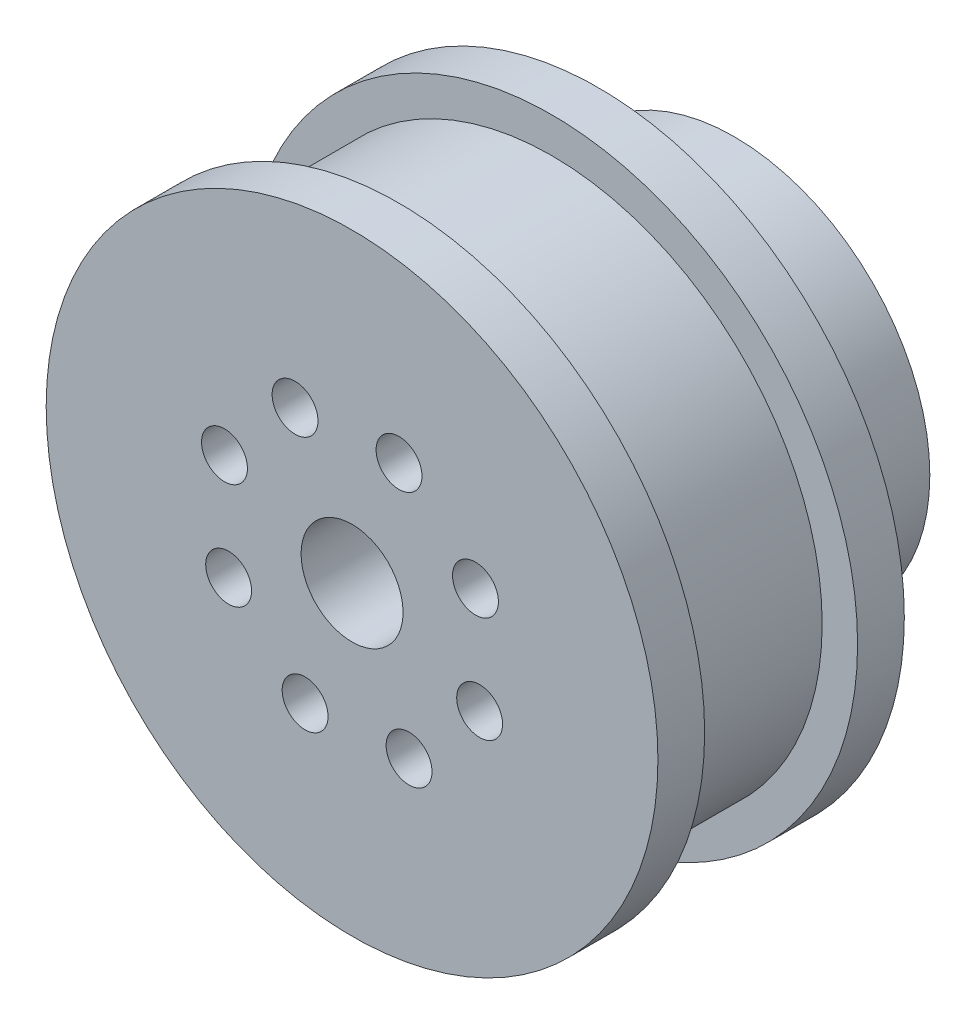
ISO-10303-21;
HEADER;
FILE_DESCRIPTION(('STEP AP214'),'2;1');
FILE_NAME('part.step','',(''),(''),'','','');
FILE_SCHEMA(('AUTOMOTIVE_DESIGN { 1 0 10303 214 1 1 1 1 }'));
ENDSEC;
DATA;
#1=APPLICATION_CONTEXT('core data for automotive mechanical design processes');
#2=APPLICATION_PROTOCOL_DEFINITION('international standard','automotive_design',2000,#1);
#3=PRODUCT_CONTEXT('',#1,'mechanical');
#4=PRODUCT('Part','Part','',(#3));
#5=PRODUCT_RELATED_PRODUCT_CATEGORY('part','',(#4));
#6=PRODUCT_DEFINITION_FORMATION('','',#4);
#7=PRODUCT_DEFINITION_CONTEXT('part definition',#1,'design');
#8=PRODUCT_DEFINITION('design','',#6,#7);
#9=PRODUCT_DEFINITION_SHAPE('','',#8);
#10=(LENGTH_UNIT() NAMED_UNIT(*) SI_UNIT(.MILLI.,.METRE.));
#11=(NAMED_UNIT(*) PLANE_ANGLE_UNIT() SI_UNIT($,.RADIAN.));
#12=(NAMED_UNIT(*) SI_UNIT($,.STERADIAN.) SOLID_ANGLE_UNIT());
#13=UNCERTAINTY_MEASURE_WITH_UNIT(LENGTH_MEASURE(1.E-05),#10,'distance_accuracy_value','');
#14=(GEOMETRIC_REPRESENTATION_CONTEXT(3) GLOBAL_UNCERTAINTY_ASSIGNED_CONTEXT((#13)) GLOBAL_UNIT_ASSIGNED_CONTEXT((#10,
#11,#12)) REPRESENTATION_CONTEXT('',''));
#15=CARTESIAN_POINT('',(0.,0.,0.));
#16=DIRECTION('',(0.,0.,1.));
#17=DIRECTION('',(1.,0.,0.));
#18=AXIS2_PLACEMENT_3D('',#15,#16,#17);
#19=CARTESIAN_POINT('',(0.,0.,14.5));
#20=DIRECTION('',(0.,0.,-1.));
#21=DIRECTION('',(-1.,0.,0.));
#22=AXIS2_PLACEMENT_3D('',#19,#20,#21);
#23=CYLINDRICAL_SURFACE('',#22,3.);
#24=CARTESIAN_POINT('',(0.,0.,14.5));
#25=DIRECTION('',(0.,0.,-1.));
#26=DIRECTION('',(-1.,0.,0.));
#27=AXIS2_PLACEMENT_3D('',#24,#25,#26);
#28=CIRCLE('',#27,3.);
#29=CARTESIAN_POINT('',(-3.,0.,14.5));
#30=VERTEX_POINT('',#29);
#31=EDGE_CURVE('E63',#30,#30,#28,.T.);
#32=ORIENTED_EDGE('',*,*,#31,.F.);
#33=EDGE_LOOP('',(#32));
#34=FACE_BOUND('',#33,.T.);
#35=CARTESIAN_POINT('',(0.,0.,2.));
#36=DIRECTION('',(0.,0.,-1.));
#37=DIRECTION('',(-1.,0.,0.));
#38=AXIS2_PLACEMENT_3D('',#35,#36,#37);
#39=CIRCLE('',#38,3.);
#40=CARTESIAN_POINT('',(-3.,0.,2.));
#41=VERTEX_POINT('',#40);
#42=EDGE_CURVE('E35',#41,#41,#39,.F.);
#43=ORIENTED_EDGE('',*,*,#42,.F.);
#44=EDGE_LOOP('',(#43));
#45=FACE_BOUND('',#44,.T.);
#46=ADVANCED_FACE('F31',(#34,#45),#23,.F.);
#47=CARTESIAN_POINT('',(0.,0.,0.));
#48=DIRECTION('',(0.,0.,1.));
#49=DIRECTION('',(1.,0.,0.));
#50=AXIS2_PLACEMENT_3D('',#47,#48,#49);
#51=PLANE('',#50);
#52=CARTESIAN_POINT('',(0.,0.,0.));
#53=DIRECTION('',(0.,0.,1.));
#54=DIRECTION('',(1.,0.,0.));
#55=AXIS2_PLACEMENT_3D('',#52,#53,#54);
#56=CIRCLE('',#55,18.);
#57=CARTESIAN_POINT('',(18.,0.,0.));
#58=VERTEX_POINT('',#57);
#59=EDGE_CURVE('E43',#58,#58,#56,.T.);
#60=ORIENTED_EDGE('',*,*,#59,.F.);
#61=EDGE_LOOP('',(#60));
#62=FACE_BOUND('',#61,.T.);
#63=CARTESIAN_POINT('',(0.,0.,0.));
#64=DIRECTION('',(0.,0.,1.));
#65=DIRECTION('',(1.,0.,0.));
#66=AXIS2_PLACEMENT_3D('',#63,#64,#65);
#67=CIRCLE('',#66,11.5);
#68=CARTESIAN_POINT('',(11.5,0.,0.));
#69=VERTEX_POINT('',#68);
#70=EDGE_CURVE('E10',#69,#69,#67,.F.);
#71=ORIENTED_EDGE('',*,*,#70,.F.);
#72=EDGE_LOOP('',(#71));
#73=FACE_BOUND('',#72,.T.);
#74=ADVANCED_FACE('F165',(#62,#73),#51,.F.);
#75=CARTESIAN_POINT('',(0.,0.,2.75));
#76=DIRECTION('',(0.,0.,1.));
#77=DIRECTION('',(1.,0.,0.));
#78=AXIS2_PLACEMENT_3D('',#75,#76,#77);
#79=PLANE('',#78);
#80=CARTESIAN_POINT('',(0.,0.,2.75));
#81=DIRECTION('',(0.,0.,1.));
#82=DIRECTION('',(1.,0.,0.));
#83=AXIS2_PLACEMENT_3D('',#80,#81,#82);
#84=CIRCLE('',#83,18.);
#85=CARTESIAN_POINT('',(18.,0.,2.75));
#86=VERTEX_POINT('',#85);
#87=EDGE_CURVE('E39',#86,#86,#84,.T.);
#88=ORIENTED_EDGE('',*,*,#87,.T.);
#89=EDGE_LOOP('',(#88));
#90=FACE_BOUND('',#89,.T.);
#91=CARTESIAN_POINT('',(0.,0.,2.75));
#92=DIRECTION('',(0.,0.,1.));
#93=DIRECTION('',(1.,0.,0.));
#94=AXIS2_PLACEMENT_3D('',#91,#92,#93);
#95=CIRCLE('',#94,15.915);
#96=CARTESIAN_POINT('',(15.915,0.,2.75));
#97=VERTEX_POINT('',#96);
#98=EDGE_CURVE('E49',#97,#97,#95,.T.);
#99=ORIENTED_EDGE('',*,*,#98,.F.);
#100=EDGE_LOOP('',(#99));
#101=FACE_BOUND('',#100,.T.);
#102=ADVANCED_FACE('F172',(#90,#101),#79,.T.);
#103=CARTESIAN_POINT('',(0.,0.,2.75));
#104=DIRECTION('',(0.,0.,-1.));
#105=DIRECTION('',(-1.,0.,0.));
#106=AXIS2_PLACEMENT_3D('',#103,#104,#105);
#107=CYLINDRICAL_SURFACE('',#106,18.);
#108=ORIENTED_EDGE('',*,*,#87,.F.);
#109=EDGE_LOOP('',(#108));
#110=FACE_BOUND('',#109,.T.);
#111=ORIENTED_EDGE('',*,*,#59,.T.);
#112=EDGE_LOOP('',(#111));
#113=FACE_BOUND('',#112,.T.);
#114=ADVANCED_FACE('F33',(#110,#113),#107,.T.);
#115=CARTESIAN_POINT('',(0.,0.,11.75));
#116=DIRECTION('',(0.,0.,-1.));
#117=DIRECTION('',(-1.,0.,0.));
#118=AXIS2_PLACEMENT_3D('',#115,#116,#117);
#119=CYLINDRICAL_SURFACE('',#118,15.915);
#120=CARTESIAN_POINT('',(0.,0.,11.75));
#121=DIRECTION('',(0.,0.,1.));
#122=DIRECTION('',(1.,0.,0.));
#123=AXIS2_PLACEMENT_3D('',#120,#121,#122);
#124=CIRCLE('',#123,15.915);
#125=CARTESIAN_POINT('',(15.915,0.,11.75));
#126=VERTEX_POINT('',#125);
#127=EDGE_CURVE('E47',#126,#126,#124,.T.);
#128=ORIENTED_EDGE('',*,*,#127,.F.);
#129=EDGE_LOOP('',(#128));
#130=FACE_BOUND('',#129,.T.);
#131=ORIENTED_EDGE('',*,*,#98,.T.);
#132=EDGE_LOOP('',(#131));
#133=FACE_BOUND('',#132,.T.);
#134=ADVANCED_FACE('F238',(#130,#133),#119,.T.);
#135=CARTESIAN_POINT('',(0.,0.,11.75));
#136=DIRECTION('',(0.,0.,1.));
#137=DIRECTION('',(1.,0.,0.));
#138=AXIS2_PLACEMENT_3D('',#135,#136,#137);
#139=PLANE('',#138);
#140=CARTESIAN_POINT('',(0.,0.,11.75));
#141=DIRECTION('',(0.,0.,1.));
#142=DIRECTION('',(1.,0.,0.));
#143=AXIS2_PLACEMENT_3D('',#140,#141,#142);
#144=CIRCLE('',#143,18.);
#145=CARTESIAN_POINT('',(18.,0.,11.75));
#146=VERTEX_POINT('',#145);
#147=EDGE_CURVE('E55',#146,#146,#144,.T.);
#148=ORIENTED_EDGE('',*,*,#147,.F.);
#149=EDGE_LOOP('',(#148));
#150=FACE_BOUND('',#149,.T.);
#151=ORIENTED_EDGE('',*,*,#127,.T.);
#152=EDGE_LOOP('',(#151));
#153=FACE_BOUND('',#152,.T.);
#154=ADVANCED_FACE('F232',(#150,#153),#139,.F.);
#155=CARTESIAN_POINT('',(0.,0.,14.5));
#156=DIRECTION('',(0.,0.,-1.));
#157=DIRECTION('',(-1.,0.,0.));
#158=AXIS2_PLACEMENT_3D('',#155,#156,#157);
#159=CYLINDRICAL_SURFACE('',#158,18.);
#160=CARTESIAN_POINT('',(0.,0.,14.5));
#161=DIRECTION('',(0.,0.,1.));
#162=DIRECTION('',(1.,0.,0.));
#163=AXIS2_PLACEMENT_3D('',#160,#161,#162);
#164=CIRCLE('',#163,18.);
#165=CARTESIAN_POINT('',(18.,0.,14.5));
#166=VERTEX_POINT('',#165);
#167=EDGE_CURVE('E52',#166,#166,#164,.T.);
#168=ORIENTED_EDGE('',*,*,#167,.F.);
#169=EDGE_LOOP('',(#168));
#170=FACE_BOUND('',#169,.T.);
#171=ORIENTED_EDGE('',*,*,#147,.T.);
#172=EDGE_LOOP('',(#171));
#173=FACE_BOUND('',#172,.T.);
#174=ADVANCED_FACE('F162',(#170,#173),#159,.T.);
#175=CARTESIAN_POINT('',(0.,0.,14.5));
#176=DIRECTION('',(0.,0.,1.));
#177=DIRECTION('',(1.,0.,0.));
#178=AXIS2_PLACEMENT_3D('',#175,#176,#177);
#179=PLANE('',#178);
#180=CARTESIAN_POINT('',(-7.50750981873218,2.76356587068952,14.5));
#181=DIRECTION('',(0.,0.,-1.));
#182=DIRECTION('',(-0.707106781186554,-0.707106781186541,0.));
#183=AXIS2_PLACEMENT_3D('',#180,#181,#182);
#184=CIRCLE('',#183,1.35);
#185=CARTESIAN_POINT('',(-8.46210397333403,1.80897171608769,14.5));
#186=VERTEX_POINT('',#185);
#187=EDGE_CURVE('E112',#186,#186,#184,.T.);
#188=ORIENTED_EDGE('',*,*,#187,.T.);
#189=EDGE_LOOP('',(#188));
#190=FACE_BOUND('',#189,.T.);
#191=CARTESIAN_POINT('',(-7.26274727007037,-3.35447493522986,14.5));
#192=DIRECTION('',(0.,0.,-1.));
#193=DIRECTION('',(0.,-1.,0.));
#194=AXIS2_PLACEMENT_3D('',#191,#192,#193);
#195=CIRCLE('',#194,1.35);
#196=CARTESIAN_POINT('',(-7.26274727007038,-4.70447493522986,14.5));
#197=VERTEX_POINT('',#196);
#198=EDGE_CURVE('E106',#197,#197,#195,.T.);
#199=ORIENTED_EDGE('',*,*,#198,.T.);
#200=EDGE_LOOP('',(#199));
#201=FACE_BOUND('',#200,.T.);
#202=CARTESIAN_POINT('',(-2.76356587068949,-7.50750981873219,14.5));
#203=DIRECTION('',(0.,0.,-1.));
#204=DIRECTION('',(0.707106781186543,-0.707106781186552,0.));
#205=AXIS2_PLACEMENT_3D('',#202,#203,#204);
#206=CIRCLE('',#205,1.35);
#207=CARTESIAN_POINT('',(-1.80897171608766,-8.46210397333403,14.5));
#208=VERTEX_POINT('',#207);
#209=EDGE_CURVE('E100',#208,#208,#206,.T.);
#210=ORIENTED_EDGE('',*,*,#209,.T.);
#211=EDGE_LOOP('',(#210));
#212=FACE_BOUND('',#211,.T.);
#213=CARTESIAN_POINT('',(3.35447493522988,-7.26274727007036,14.5));
#214=DIRECTION('',(0.,0.,-1.));
#215=DIRECTION('',(1.,0.,0.));
#216=AXIS2_PLACEMENT_3D('',#213,#214,#215);
#217=CIRCLE('',#216,1.35);
#218=CARTESIAN_POINT('',(4.70447493522988,-7.26274727007037,14.5));
#219=VERTEX_POINT('',#218);
#220=EDGE_CURVE('E94',#219,#219,#217,.T.);
#221=ORIENTED_EDGE('',*,*,#220,.T.);
#222=EDGE_LOOP('',(#221));
#223=FACE_BOUND('',#222,.T.);
#224=CARTESIAN_POINT('',(7.5075098187322,-2.76356587068948,14.5));
#225=DIRECTION('',(0.,0.,-1.));
#226=DIRECTION('',(0.70710678118655,0.707106781186545,0.));
#227=AXIS2_PLACEMENT_3D('',#224,#225,#226);
#228=CIRCLE('',#227,1.35);
#229=CARTESIAN_POINT('',(8.46210397333404,-1.80897171608764,14.5));
#230=VERTEX_POINT('',#229);
#231=EDGE_CURVE('E88',#230,#230,#228,.T.);
#232=ORIENTED_EDGE('',*,*,#231,.T.);
#233=EDGE_LOOP('',(#232));
#234=FACE_BOUND('',#233,.T.);
#235=CARTESIAN_POINT('',(7.26274727007035,3.3544749352299,14.5));
#236=DIRECTION('',(0.,0.,-1.));
#237=DIRECTION('',(0.,1.,0.));
#238=AXIS2_PLACEMENT_3D('',#235,#236,#237);
#239=CIRCLE('',#238,1.35);
#240=CARTESIAN_POINT('',(7.26274727007036,4.7044749352299,14.5));
#241=VERTEX_POINT('',#240);
#242=EDGE_CURVE('E82',#241,#241,#239,.T.);
#243=ORIENTED_EDGE('',*,*,#242,.T.);
#244=EDGE_LOOP('',(#243));
#245=FACE_BOUND('',#244,.T.);
#246=CARTESIAN_POINT('',(2.76356587068946,7.5075098187322,14.5));
#247=DIRECTION('',(0.,0.,-1.));
#248=DIRECTION('',(-0.707106781186547,0.707106781186548,0.));
#249=AXIS2_PLACEMENT_3D('',#246,#247,#248);
#250=CIRCLE('',#249,1.35);
#251=CARTESIAN_POINT('',(1.80897171608762,8.46210397333405,14.5));
#252=VERTEX_POINT('',#251);
#253=EDGE_CURVE('E76',#252,#252,#250,.T.);
#254=ORIENTED_EDGE('',*,*,#253,.T.);
#255=EDGE_LOOP('',(#254));
#256=FACE_BOUND('',#255,.T.);
#257=CARTESIAN_POINT('',(-3.35447493522992,7.26274727007035,14.5));
#258=DIRECTION('',(0.,0.,-1.));
#259=DIRECTION('',(-1.,0.,0.));
#260=AXIS2_PLACEMENT_3D('',#257,#258,#259);
#261=CIRCLE('',#260,1.35);
#262=CARTESIAN_POINT('',(-4.70447493522992,7.26274727007035,14.5));
#263=VERTEX_POINT('',#262);
#264=EDGE_CURVE('E70',#263,#263,#261,.T.);
#265=ORIENTED_EDGE('',*,*,#264,.T.);
#266=EDGE_LOOP('',(#265));
#267=FACE_BOUND('',#266,.T.);
#268=ORIENTED_EDGE('',*,*,#31,.T.);
#269=EDGE_LOOP('',(#268));
#270=FACE_BOUND('',#269,.T.);
#271=ORIENTED_EDGE('',*,*,#167,.T.);
#272=EDGE_LOOP('',(#271));
#273=FACE_BOUND('',#272,.T.);
#274=ADVANCED_FACE('F121',(#190,#201,#212,#223,#234,#245,#256,#267,#270,#273),#179,.T.);
#275=CARTESIAN_POINT('',(0.,0.,-8.));
#276=DIRECTION('',(0.,0.,1.));
#277=DIRECTION('',(1.,0.,0.));
#278=AXIS2_PLACEMENT_3D('',#275,#276,#277);
#279=CYLINDRICAL_SURFACE('',#278,11.5);
#280=CARTESIAN_POINT('',(0.,0.,-8.));
#281=DIRECTION('',(0.,0.,-1.));
#282=DIRECTION('',(-1.,0.,0.));
#283=AXIS2_PLACEMENT_3D('',#280,#281,#282);
#284=CIRCLE('',#283,11.5);
#285=CARTESIAN_POINT('',(-11.5,0.,-8.));
#286=VERTEX_POINT('',#285);
#287=EDGE_CURVE('E58',#286,#286,#284,.T.);
#288=ORIENTED_EDGE('',*,*,#287,.F.);
#289=EDGE_LOOP('',(#288));
#290=FACE_BOUND('',#289,.T.);
#291=ORIENTED_EDGE('',*,*,#70,.T.);
#292=EDGE_LOOP('',(#291));
#293=FACE_BOUND('',#292,.T.);
#294=ADVANCED_FACE('F135',(#290,#293),#279,.T.);
#295=CARTESIAN_POINT('',(0.,0.,-8.));
#296=DIRECTION('',(0.,0.,-1.));
#297=DIRECTION('',(-1.,0.,0.));
#298=AXIS2_PLACEMENT_3D('',#295,#296,#297);
#299=PLANE('',#298);
#300=CARTESIAN_POINT('',(-7.50750981873218,2.76356587068952,-8.));
#301=DIRECTION('',(0.,0.,-1.));
#302=DIRECTION('',(-0.707106781186554,-0.707106781186541,0.));
#303=AXIS2_PLACEMENT_3D('',#300,#301,#302);
#304=CIRCLE('',#303,1.35);
#305=CARTESIAN_POINT('',(-8.46210397333403,1.80897171608769,-8.));
#306=VERTEX_POINT('',#305);
#307=EDGE_CURVE('E115',#306,#306,#304,.T.);
#308=ORIENTED_EDGE('',*,*,#307,.F.);
#309=EDGE_LOOP('',(#308));
#310=FACE_BOUND('',#309,.T.);
#311=CARTESIAN_POINT('',(-7.26274727007037,-3.35447493522986,-8.));
#312=DIRECTION('',(0.,0.,-1.));
#313=DIRECTION('',(0.,-1.,0.));
#314=AXIS2_PLACEMENT_3D('',#311,#312,#313);
#315=CIRCLE('',#314,1.35);
#316=CARTESIAN_POINT('',(-7.26274727007038,-4.70447493522986,-8.));
#317=VERTEX_POINT('',#316);
#318=EDGE_CURVE('E109',#317,#317,#315,.T.);
#319=ORIENTED_EDGE('',*,*,#318,.F.);
#320=EDGE_LOOP('',(#319));
#321=FACE_BOUND('',#320,.T.);
#322=CARTESIAN_POINT('',(-2.76356587068949,-7.50750981873219,-8.));
#323=DIRECTION('',(0.,0.,-1.));
#324=DIRECTION('',(0.707106781186543,-0.707106781186552,0.));
#325=AXIS2_PLACEMENT_3D('',#322,#323,#324);
#326=CIRCLE('',#325,1.35);
#327=CARTESIAN_POINT('',(-1.80897171608766,-8.46210397333403,-8.));
#328=VERTEX_POINT('',#327);
#329=EDGE_CURVE('E103',#328,#328,#326,.T.);
#330=ORIENTED_EDGE('',*,*,#329,.F.);
#331=EDGE_LOOP('',(#330));
#332=FACE_BOUND('',#331,.T.);
#333=CARTESIAN_POINT('',(3.35447493522988,-7.26274727007036,-8.));
#334=DIRECTION('',(0.,0.,-1.));
#335=DIRECTION('',(1.,0.,0.));
#336=AXIS2_PLACEMENT_3D('',#333,#334,#335);
#337=CIRCLE('',#336,1.35);
#338=CARTESIAN_POINT('',(4.70447493522988,-7.26274727007037,-8.));
#339=VERTEX_POINT('',#338);
#340=EDGE_CURVE('E97',#339,#339,#337,.T.);
#341=ORIENTED_EDGE('',*,*,#340,.F.);
#342=EDGE_LOOP('',(#341));
#343=FACE_BOUND('',#342,.T.);
#344=CARTESIAN_POINT('',(7.5075098187322,-2.76356587068948,-8.));
#345=DIRECTION('',(0.,0.,-1.));
#346=DIRECTION('',(0.70710678118655,0.707106781186545,0.));
#347=AXIS2_PLACEMENT_3D('',#344,#345,#346);
#348=CIRCLE('',#347,1.35);
#349=CARTESIAN_POINT('',(8.46210397333404,-1.80897171608764,-8.));
#350=VERTEX_POINT('',#349);
#351=EDGE_CURVE('E91',#350,#350,#348,.T.);
#352=ORIENTED_EDGE('',*,*,#351,.F.);
#353=EDGE_LOOP('',(#352));
#354=FACE_BOUND('',#353,.T.);
#355=CARTESIAN_POINT('',(7.26274727007035,3.3544749352299,-8.));
#356=DIRECTION('',(0.,0.,-1.));
#357=DIRECTION('',(0.,1.,0.));
#358=AXIS2_PLACEMENT_3D('',#355,#356,#357);
#359=CIRCLE('',#358,1.35);
#360=CARTESIAN_POINT('',(7.26274727007036,4.7044749352299,-8.));
#361=VERTEX_POINT('',#360);
#362=EDGE_CURVE('E85',#361,#361,#359,.T.);
#363=ORIENTED_EDGE('',*,*,#362,.F.);
#364=EDGE_LOOP('',(#363));
#365=FACE_BOUND('',#364,.T.);
#366=CARTESIAN_POINT('',(2.76356587068946,7.5075098187322,-8.));
#367=DIRECTION('',(0.,0.,-1.));
#368=DIRECTION('',(-0.707106781186547,0.707106781186548,0.));
#369=AXIS2_PLACEMENT_3D('',#366,#367,#368);
#370=CIRCLE('',#369,1.35);
#371=CARTESIAN_POINT('',(1.80897171608762,8.46210397333405,-8.));
#372=VERTEX_POINT('',#371);
#373=EDGE_CURVE('E79',#372,#372,#370,.T.);
#374=ORIENTED_EDGE('',*,*,#373,.F.);
#375=EDGE_LOOP('',(#374));
#376=FACE_BOUND('',#375,.T.);
#377=CARTESIAN_POINT('',(-3.35447493522992,7.26274727007035,-8.));
#378=DIRECTION('',(0.,0.,-1.));
#379=DIRECTION('',(-1.,0.,0.));
#380=AXIS2_PLACEMENT_3D('',#377,#378,#379);
#381=CIRCLE('',#380,1.35);
#382=CARTESIAN_POINT('',(-4.70447493522992,7.26274727007035,-8.));
#383=VERTEX_POINT('',#382);
#384=EDGE_CURVE('E73',#383,#383,#381,.T.);
#385=ORIENTED_EDGE('',*,*,#384,.F.);
#386=EDGE_LOOP('',(#385));
#387=FACE_BOUND('',#386,.T.);
#388=CARTESIAN_POINT('',(0.,0.,-8.));
#389=DIRECTION('',(0.,0.,-1.));
#390=DIRECTION('',(-1.,0.,0.));
#391=AXIS2_PLACEMENT_3D('',#388,#389,#390);
#392=CIRCLE('',#391,4.);
#393=CARTESIAN_POINT('',(-4.,0.,-8.));
#394=VERTEX_POINT('',#393);
#395=EDGE_CURVE('E66',#394,#394,#392,.T.);
#396=ORIENTED_EDGE('',*,*,#395,.F.);
#397=EDGE_LOOP('',(#396));
#398=FACE_BOUND('',#397,.T.);
#399=ORIENTED_EDGE('',*,*,#287,.T.);
#400=EDGE_LOOP('',(#399));
#401=FACE_BOUND('',#400,.T.);
#402=ADVANCED_FACE('F131',(#310,#321,#332,#343,#354,#365,#376,#387,#398,#401),#299,.T.);
#403=CARTESIAN_POINT('',(0.,0.,2.));
#404=DIRECTION('',(0.,0.,-1.));
#405=DIRECTION('',(-1.,0.,0.));
#406=AXIS2_PLACEMENT_3D('',#403,#404,#405);
#407=PLANE('',#406);
#408=CARTESIAN_POINT('',(0.,0.,2.));
#409=DIRECTION('',(0.,0.,-1.));
#410=DIRECTION('',(-1.,0.,0.));
#411=AXIS2_PLACEMENT_3D('',#408,#409,#410);
#412=CIRCLE('',#411,4.);
#413=CARTESIAN_POINT('',(-4.,0.,2.));
#414=VERTEX_POINT('',#413);
#415=EDGE_CURVE('E69',#414,#414,#412,.T.);
#416=ORIENTED_EDGE('',*,*,#415,.T.);
#417=EDGE_LOOP('',(#416));
#418=FACE_BOUND('',#417,.T.);
#419=ORIENTED_EDGE('',*,*,#42,.T.);
#420=EDGE_LOOP('',(#419));
#421=FACE_BOUND('',#420,.T.);
#422=ADVANCED_FACE('F134',(#418,#421),#407,.T.);
#423=CARTESIAN_POINT('',(0.,0.,2.));
#424=DIRECTION('',(0.,0.,-1.));
#425=DIRECTION('',(-1.,0.,0.));
#426=AXIS2_PLACEMENT_3D('',#423,#424,#425);
#427=CYLINDRICAL_SURFACE('',#426,4.);
#428=ORIENTED_EDGE('',*,*,#415,.F.);
#429=EDGE_LOOP('',(#428));
#430=FACE_BOUND('',#429,.T.);
#431=ORIENTED_EDGE('',*,*,#395,.T.);
#432=EDGE_LOOP('',(#431));
#433=FACE_BOUND('',#432,.T.);
#434=ADVANCED_FACE('F177',(#430,#433),#427,.F.);
#435=CARTESIAN_POINT('',(-3.35447493522992,7.26274727007035,14.5));
#436=DIRECTION('',(0.,0.,-1.));
#437=DIRECTION('',(-1.,0.,0.));
#438=AXIS2_PLACEMENT_3D('',#435,#436,#437);
#439=CYLINDRICAL_SURFACE('',#438,1.35);
#440=ORIENTED_EDGE('',*,*,#264,.F.);
#441=EDGE_LOOP('',(#440));
#442=FACE_BOUND('',#441,.T.);
#443=ORIENTED_EDGE('',*,*,#384,.T.);
#444=EDGE_LOOP('',(#443));
#445=FACE_BOUND('',#444,.T.);
#446=ADVANCED_FACE('F180',(#442,#445),#439,.F.);
#447=CARTESIAN_POINT('',(2.76356587068946,7.5075098187322,14.5));
#448=DIRECTION('',(0.,0.,-1.));
#449=DIRECTION('',(-1.,0.,0.));
#450=AXIS2_PLACEMENT_3D('',#447,#448,#449);
#451=CYLINDRICAL_SURFACE('',#450,1.35);
#452=ORIENTED_EDGE('',*,*,#253,.F.);
#453=EDGE_LOOP('',(#452));
#454=FACE_BOUND('',#453,.T.);
#455=ORIENTED_EDGE('',*,*,#373,.T.);
#456=EDGE_LOOP('',(#455));
#457=FACE_BOUND('',#456,.T.);
#458=ADVANCED_FACE('F187',(#454,#457),#451,.F.);
#459=CARTESIAN_POINT('',(7.26274727007035,3.3544749352299,14.5));
#460=DIRECTION('',(0.,0.,-1.));
#461=DIRECTION('',(-1.,0.,0.));
#462=AXIS2_PLACEMENT_3D('',#459,#460,#461);
#463=CYLINDRICAL_SURFACE('',#462,1.35);
#464=ORIENTED_EDGE('',*,*,#242,.F.);
#465=EDGE_LOOP('',(#464));
#466=FACE_BOUND('',#465,.T.);
#467=ORIENTED_EDGE('',*,*,#362,.T.);
#468=EDGE_LOOP('',(#467));
#469=FACE_BOUND('',#468,.T.);
#470=ADVANCED_FACE('F191',(#466,#469),#463,.F.);
#471=CARTESIAN_POINT('',(7.5075098187322,-2.76356587068948,14.5));
#472=DIRECTION('',(0.,0.,-1.));
#473=DIRECTION('',(-1.,0.,0.));
#474=AXIS2_PLACEMENT_3D('',#471,#472,#473);
#475=CYLINDRICAL_SURFACE('',#474,1.35);
#476=ORIENTED_EDGE('',*,*,#231,.F.);
#477=EDGE_LOOP('',(#476));
#478=FACE_BOUND('',#477,.T.);
#479=ORIENTED_EDGE('',*,*,#351,.T.);
#480=EDGE_LOOP('',(#479));
#481=FACE_BOUND('',#480,.T.);
#482=ADVANCED_FACE('F195',(#478,#481),#475,.F.);
#483=CARTESIAN_POINT('',(3.35447493522988,-7.26274727007036,14.5));
#484=DIRECTION('',(0.,0.,-1.));
#485=DIRECTION('',(-1.,0.,0.));
#486=AXIS2_PLACEMENT_3D('',#483,#484,#485);
#487=CYLINDRICAL_SURFACE('',#486,1.35);
#488=ORIENTED_EDGE('',*,*,#220,.F.);
#489=EDGE_LOOP('',(#488));
#490=FACE_BOUND('',#489,.T.);
#491=ORIENTED_EDGE('',*,*,#340,.T.);
#492=EDGE_LOOP('',(#491));
#493=FACE_BOUND('',#492,.T.);
#494=ADVANCED_FACE('F199',(#490,#493),#487,.F.);
#495=CARTESIAN_POINT('',(-2.76356587068949,-7.50750981873219,14.5));
#496=DIRECTION('',(0.,0.,-1.));
#497=DIRECTION('',(-1.,0.,0.));
#498=AXIS2_PLACEMENT_3D('',#495,#496,#497);
#499=CYLINDRICAL_SURFACE('',#498,1.35);
#500=ORIENTED_EDGE('',*,*,#209,.F.);
#501=EDGE_LOOP('',(#500));
#502=FACE_BOUND('',#501,.T.);
#503=ORIENTED_EDGE('',*,*,#329,.T.);
#504=EDGE_LOOP('',(#503));
#505=FACE_BOUND('',#504,.T.);
#506=ADVANCED_FACE('F203',(#502,#505),#499,.F.);
#507=CARTESIAN_POINT('',(-7.26274727007037,-3.35447493522986,14.5));
#508=DIRECTION('',(0.,0.,-1.));
#509=DIRECTION('',(-1.,0.,0.));
#510=AXIS2_PLACEMENT_3D('',#507,#508,#509);
#511=CYLINDRICAL_SURFACE('',#510,1.35);
#512=ORIENTED_EDGE('',*,*,#198,.F.);
#513=EDGE_LOOP('',(#512));
#514=FACE_BOUND('',#513,.T.);
#515=ORIENTED_EDGE('',*,*,#318,.T.);
#516=EDGE_LOOP('',(#515));
#517=FACE_BOUND('',#516,.T.);
#518=ADVANCED_FACE('F127',(#514,#517),#511,.F.);
#519=CARTESIAN_POINT('',(-7.50750981873218,2.76356587068952,14.5));
#520=DIRECTION('',(0.,0.,-1.));
#521=DIRECTION('',(-1.,0.,0.));
#522=AXIS2_PLACEMENT_3D('',#519,#520,#521);
#523=CYLINDRICAL_SURFACE('',#522,1.35);
#524=ORIENTED_EDGE('',*,*,#187,.F.);
#525=EDGE_LOOP('',(#524));
#526=FACE_BOUND('',#525,.T.);
#527=ORIENTED_EDGE('',*,*,#307,.T.);
#528=EDGE_LOOP('',(#527));
#529=FACE_BOUND('',#528,.T.);
#530=ADVANCED_FACE('F124',(#526,#529),#523,.F.);
#531=CLOSED_SHELL('',(#46,#74,#102,#114,#134,#154,#174,#274,#294,#402,#422,#434,#446,#458,#470,
#482,#494,#506,#518,#530));
#532=MANIFOLD_SOLID_BREP('B2',#531);
#533=ADVANCED_BREP_SHAPE_REPRESENTATION('',(#18,#532),#14);
#534=SHAPE_DEFINITION_REPRESENTATION(#9,#533);
ENDSEC;
END-ISO-10303-21;
